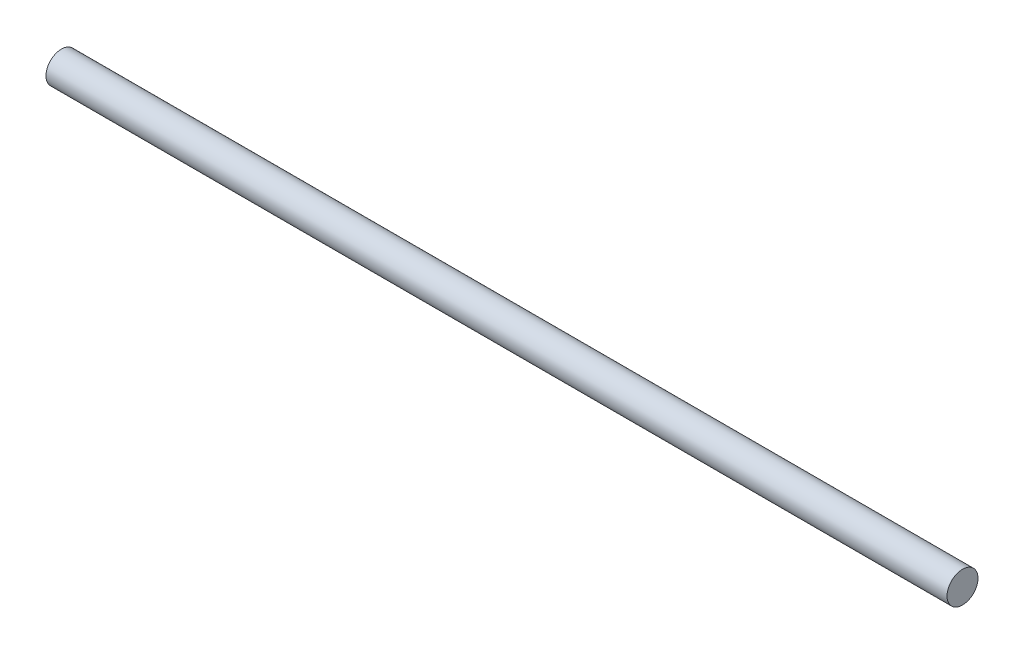
ISO-10303-21;
HEADER;
FILE_DESCRIPTION(('STEP AP214'),'2;1');
FILE_NAME('part.step','',(''),(''),'','','');
FILE_SCHEMA(('AUTOMOTIVE_DESIGN { 1 0 10303 214 1 1 1 1 }'));
ENDSEC;
DATA;
#1=APPLICATION_CONTEXT('core data for automotive mechanical design processes');
#2=APPLICATION_PROTOCOL_DEFINITION('international standard','automotive_design',2000,#1);
#3=PRODUCT_CONTEXT('',#1,'mechanical');
#4=PRODUCT('Part','Part','',(#3));
#5=PRODUCT_RELATED_PRODUCT_CATEGORY('part','',(#4));
#6=PRODUCT_DEFINITION_FORMATION('','',#4);
#7=PRODUCT_DEFINITION_CONTEXT('part definition',#1,'design');
#8=PRODUCT_DEFINITION('design','',#6,#7);
#9=PRODUCT_DEFINITION_SHAPE('','',#8);
#10=(LENGTH_UNIT() NAMED_UNIT(*) SI_UNIT(.MILLI.,.METRE.));
#11=(NAMED_UNIT(*) PLANE_ANGLE_UNIT() SI_UNIT($,.RADIAN.));
#12=(NAMED_UNIT(*) SI_UNIT($,.STERADIAN.) SOLID_ANGLE_UNIT());
#13=UNCERTAINTY_MEASURE_WITH_UNIT(LENGTH_MEASURE(1.E-05),#10,'distance_accuracy_value','');
#14=(GEOMETRIC_REPRESENTATION_CONTEXT(3) GLOBAL_UNCERTAINTY_ASSIGNED_CONTEXT((#13)) GLOBAL_UNIT_ASSIGNED_CONTEXT((#10,
#11,#12)) REPRESENTATION_CONTEXT('',''));
#15=CARTESIAN_POINT('',(0.,0.,0.));
#16=DIRECTION('',(0.,0.,1.));
#17=DIRECTION('',(1.,0.,0.));
#18=AXIS2_PLACEMENT_3D('',#15,#16,#17);
#19=CARTESIAN_POINT('',(873.,0.,0.));
#20=DIRECTION('',(-1.,0.,0.));
#21=DIRECTION('',(0.,0.,1.));
#22=AXIS2_PLACEMENT_3D('',#19,#20,#21);
#23=CYLINDRICAL_SURFACE('',#22,15.);
#24=CARTESIAN_POINT('',(873.,0.,0.));
#25=DIRECTION('',(1.,0.,0.));
#26=DIRECTION('',(0.,0.,-1.));
#27=AXIS2_PLACEMENT_3D('',#24,#25,#26);
#28=CIRCLE('',#27,15.);
#29=CARTESIAN_POINT('',(873.,0.,-15.));
#30=VERTEX_POINT('',#29);
#31=EDGE_CURVE('E10',#30,#30,#28,.T.);
#32=ORIENTED_EDGE('',*,*,#31,.F.);
#33=EDGE_LOOP('',(#32));
#34=FACE_BOUND('',#33,.T.);
#35=CARTESIAN_POINT('',(0.,0.,0.));
#36=DIRECTION('',(1.,0.,0.));
#37=DIRECTION('',(0.,0.,-1.));
#38=AXIS2_PLACEMENT_3D('',#35,#36,#37);
#39=CIRCLE('',#38,15.);
#40=CARTESIAN_POINT('',(0.,0.,-15.));
#41=VERTEX_POINT('',#40);
#42=EDGE_CURVE('E40',#41,#41,#39,.T.);
#43=ORIENTED_EDGE('',*,*,#42,.T.);
#44=EDGE_LOOP('',(#43));
#45=FACE_BOUND('',#44,.T.);
#46=ADVANCED_FACE('F37',(#34,#45),#23,.T.);
#47=CARTESIAN_POINT('',(873.,0.,0.));
#48=DIRECTION('',(1.,0.,0.));
#49=DIRECTION('',(0.,0.,-1.));
#50=AXIS2_PLACEMENT_3D('',#47,#48,#49);
#51=PLANE('',#50);
#52=ORIENTED_EDGE('',*,*,#31,.T.);
#53=EDGE_LOOP('',(#52));
#54=FACE_BOUND('',#53,.T.);
#55=ADVANCED_FACE('F54',(#54),#51,.T.);
#56=CARTESIAN_POINT('',(0.,0.,0.));
#57=DIRECTION('',(1.,0.,0.));
#58=DIRECTION('',(0.,0.,-1.));
#59=AXIS2_PLACEMENT_3D('',#56,#57,#58);
#60=PLANE('',#59);
#61=ORIENTED_EDGE('',*,*,#42,.F.);
#62=EDGE_LOOP('',(#61));
#63=FACE_BOUND('',#62,.T.);
#64=ADVANCED_FACE('F52',(#63),#60,.F.);
#65=CLOSED_SHELL('',(#46,#55,#64));
#66=MANIFOLD_SOLID_BREP('B2',#65);
#67=ADVANCED_BREP_SHAPE_REPRESENTATION('',(#18,#66),#14);
#68=SHAPE_DEFINITION_REPRESENTATION(#9,#67);
ENDSEC;
END-ISO-10303-21;
